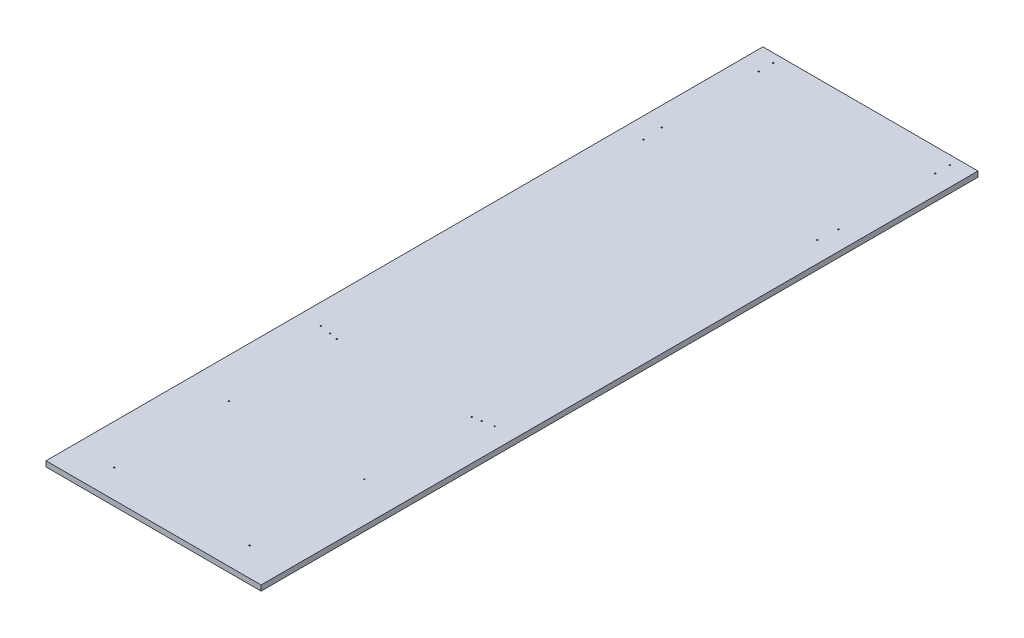
ISO-10303-21;
HEADER;
FILE_DESCRIPTION(('STEP AP214'),'2;1');
FILE_NAME('part.step','',(''),(''),'','','');
FILE_SCHEMA(('AUTOMOTIVE_DESIGN { 1 0 10303 214 1 1 1 1 }'));
ENDSEC;
DATA;
#1=APPLICATION_CONTEXT('core data for automotive mechanical design processes');
#2=APPLICATION_PROTOCOL_DEFINITION('international standard','automotive_design',2000,#1);
#3=PRODUCT_CONTEXT('',#1,'mechanical');
#4=PRODUCT('Part','Part','',(#3));
#5=PRODUCT_RELATED_PRODUCT_CATEGORY('part','',(#4));
#6=PRODUCT_DEFINITION_FORMATION('','',#4);
#7=PRODUCT_DEFINITION_CONTEXT('part definition',#1,'design');
#8=PRODUCT_DEFINITION('design','',#6,#7);
#9=PRODUCT_DEFINITION_SHAPE('','',#8);
#10=(LENGTH_UNIT() NAMED_UNIT(*) SI_UNIT(.MILLI.,.METRE.));
#11=(NAMED_UNIT(*) PLANE_ANGLE_UNIT() SI_UNIT($,.RADIAN.));
#12=(NAMED_UNIT(*) SI_UNIT($,.STERADIAN.) SOLID_ANGLE_UNIT());
#13=UNCERTAINTY_MEASURE_WITH_UNIT(LENGTH_MEASURE(1.E-05),#10,'distance_accuracy_value','');
#14=(GEOMETRIC_REPRESENTATION_CONTEXT(3) GLOBAL_UNCERTAINTY_ASSIGNED_CONTEXT((#13)) GLOBAL_UNIT_ASSIGNED_CONTEXT((#10,
#11,#12)) REPRESENTATION_CONTEXT('',''));
#15=CARTESIAN_POINT('',(0.,0.,0.));
#16=DIRECTION('',(0.,0.,1.));
#17=DIRECTION('',(1.,0.,0.));
#18=AXIS2_PLACEMENT_3D('',#15,#16,#17);
#19=CARTESIAN_POINT('',(0.,15.,0.));
#20=DIRECTION('',(0.,1.,0.));
#21=DIRECTION('',(0.,0.,1.));
#22=AXIS2_PLACEMENT_3D('',#19,#20,#21);
#23=PLANE('',#22);
#24=CARTESIAN_POINT('',(246.5,15.,-934.289321881345));
#25=DIRECTION('',(0.,1.,0.));
#26=DIRECTION('',(0.,0.,1.));
#27=AXIS2_PLACEMENT_3D('',#24,#25,#26);
#28=CIRCLE('',#27,1.74999999999999);
#29=CARTESIAN_POINT('',(246.5,15.,-932.539321881345));
#30=VERTEX_POINT('',#29);
#31=EDGE_CURVE('E205',#30,#30,#28,.T.);
#32=ORIENTED_EDGE('',*,*,#31,.F.);
#33=EDGE_LOOP('',(#32));
#34=FACE_BOUND('',#33,.T.);
#35=CARTESIAN_POINT('',(-246.5,15.,-934.289321881345));
#36=DIRECTION('',(0.,1.,0.));
#37=DIRECTION('',(0.,0.,1.));
#38=AXIS2_PLACEMENT_3D('',#35,#36,#37);
#39=CIRCLE('',#38,1.74999999999999);
#40=CARTESIAN_POINT('',(-246.5,15.,-932.539321881345));
#41=VERTEX_POINT('',#40);
#42=EDGE_CURVE('E193',#41,#41,#39,.T.);
#43=ORIENTED_EDGE('',*,*,#42,.F.);
#44=EDGE_LOOP('',(#43));
#45=FACE_BOUND('',#44,.T.);
#46=CARTESIAN_POINT('',(246.5,15.,-664.289321881345));
#47=DIRECTION('',(0.,1.,0.));
#48=DIRECTION('',(0.,0.,1.));
#49=AXIS2_PLACEMENT_3D('',#46,#47,#48);
#50=CIRCLE('',#49,1.74999999999997);
#51=CARTESIAN_POINT('',(246.5,15.,-662.539321881345));
#52=VERTEX_POINT('',#51);
#53=EDGE_CURVE('E181',#52,#52,#50,.T.);
#54=ORIENTED_EDGE('',*,*,#53,.F.);
#55=EDGE_LOOP('',(#54));
#56=FACE_BOUND('',#55,.T.);
#57=CARTESIAN_POINT('',(242.5,15.,290.710678118655));
#58=DIRECTION('',(0.,1.,0.));
#59=DIRECTION('',(0.,0.,1.));
#60=AXIS2_PLACEMENT_3D('',#57,#58,#59);
#61=CIRCLE('',#60,1.74999999999998);
#62=CARTESIAN_POINT('',(242.5,15.,292.460678118655));
#63=VERTEX_POINT('',#62);
#64=EDGE_CURVE('E169',#63,#63,#61,.T.);
#65=ORIENTED_EDGE('',*,*,#64,.F.);
#66=EDGE_LOOP('',(#65));
#67=FACE_BOUND('',#66,.T.);
#68=CARTESIAN_POINT('',(-242.5,15.,290.710678118655));
#69=DIRECTION('',(0.,1.,0.));
#70=DIRECTION('',(0.,0.,1.));
#71=AXIS2_PLACEMENT_3D('',#68,#69,#70);
#72=CIRCLE('',#71,1.75000000000001);
#73=CARTESIAN_POINT('',(-242.5,15.,292.460678118655));
#74=VERTEX_POINT('',#73);
#75=EDGE_CURVE('E157',#74,#74,#72,.T.);
#76=ORIENTED_EDGE('',*,*,#75,.F.);
#77=EDGE_LOOP('',(#76));
#78=FACE_BOUND('',#77,.T.);
#79=CARTESIAN_POINT('',(-211.5,15.,295.710678118655));
#80=DIRECTION('',(0.,1.,0.));
#81=DIRECTION('',(0.,0.,1.));
#82=AXIS2_PLACEMENT_3D('',#79,#80,#81);
#83=CIRCLE('',#82,1.75000000000001);
#84=CARTESIAN_POINT('',(-211.5,15.,297.460678118655));
#85=VERTEX_POINT('',#84);
#86=EDGE_CURVE('E145',#85,#85,#83,.T.);
#87=ORIENTED_EDGE('',*,*,#86,.F.);
#88=EDGE_LOOP('',(#87));
#89=FACE_BOUND('',#88,.T.);
#90=CARTESIAN_POINT('',(-188.5,15.,600.710678118655));
#91=DIRECTION('',(0.,1.,0.));
#92=DIRECTION('',(0.,0.,1.));
#93=AXIS2_PLACEMENT_3D('',#90,#91,#92);
#94=CIRCLE('',#93,1.74999999999999);
#95=CARTESIAN_POINT('',(-188.5,15.,602.460678118655));
#96=VERTEX_POINT('',#95);
#97=EDGE_CURVE('E133',#96,#96,#94,.T.);
#98=ORIENTED_EDGE('',*,*,#97,.F.);
#99=EDGE_LOOP('',(#98));
#100=FACE_BOUND('',#99,.T.);
#101=CARTESIAN_POINT('',(188.5,15.,600.710678118655));
#102=DIRECTION('',(0.,1.,0.));
#103=DIRECTION('',(0.,0.,1.));
#104=AXIS2_PLACEMENT_3D('',#101,#102,#103);
#105=CIRCLE('',#104,1.74999999999999);
#106=CARTESIAN_POINT('',(188.5,15.,602.460678118655));
#107=VERTEX_POINT('',#106);
#108=EDGE_CURVE('E121',#107,#107,#105,.T.);
#109=ORIENTED_EDGE('',*,*,#108,.F.);
#110=EDGE_LOOP('',(#109));
#111=FACE_BOUND('',#110,.T.);
#112=CARTESIAN_POINT('',(-188.5,15.,920.710678118655));
#113=DIRECTION('',(0.,1.,0.));
#114=DIRECTION('',(0.,0.,1.));
#115=AXIS2_PLACEMENT_3D('',#112,#113,#114);
#116=CIRCLE('',#115,1.74999999999999);
#117=CARTESIAN_POINT('',(-188.5,15.,922.460678118655));
#118=VERTEX_POINT('',#117);
#119=EDGE_CURVE('E100',#118,#118,#116,.T.);
#120=ORIENTED_EDGE('',*,*,#119,.F.);
#121=EDGE_LOOP('',(#120));
#122=FACE_BOUND('',#121,.T.);
#123=DIRECTION('',(0.,0.,-1.));
#124=VECTOR('',#123,1.);
#125=CARTESIAN_POINT('',(300.,15.,-1000.));
#126=LINE('',#125,#124);
#127=CARTESIAN_POINT('',(300.,15.,1000.));
#128=VERTEX_POINT('',#127);
#129=CARTESIAN_POINT('',(300.,15.,-1000.));
#130=VERTEX_POINT('',#129);
#131=EDGE_CURVE('E85',#128,#130,#126,.T.);
#132=ORIENTED_EDGE('',*,*,#131,.T.);
#133=DIRECTION('',(-1.,0.,0.));
#134=VECTOR('',#133,1.);
#135=CARTESIAN_POINT('',(-300.,15.,-1000.));
#136=LINE('',#135,#134);
#137=CARTESIAN_POINT('',(-300.,15.,-1000.));
#138=VERTEX_POINT('',#137);
#139=EDGE_CURVE('E80',#130,#138,#136,.T.);
#140=ORIENTED_EDGE('',*,*,#139,.T.);
#141=DIRECTION('',(0.,0.,1.));
#142=VECTOR('',#141,1.);
#143=CARTESIAN_POINT('',(-300.,15.,-1000.));
#144=LINE('',#143,#142);
#145=CARTESIAN_POINT('',(-300.,15.,1000.));
#146=VERTEX_POINT('',#145);
#147=EDGE_CURVE('E83',#138,#146,#144,.T.);
#148=ORIENTED_EDGE('',*,*,#147,.T.);
#149=DIRECTION('',(1.,0.,0.));
#150=VECTOR('',#149,1.);
#151=CARTESIAN_POINT('',(-300.,15.,1000.));
#152=LINE('',#151,#150);
#153=EDGE_CURVE('E50',#146,#128,#152,.T.);
#154=ORIENTED_EDGE('',*,*,#153,.T.);
#155=EDGE_LOOP('',(#132,#140,#148,#154));
#156=FACE_BOUND('',#155,.T.);
#157=CARTESIAN_POINT('',(188.5,15.,920.710678118655));
#158=DIRECTION('',(0.,1.,0.));
#159=DIRECTION('',(0.,0.,1.));
#160=AXIS2_PLACEMENT_3D('',#157,#158,#159);
#161=CIRCLE('',#160,1.74999999999999);
#162=CARTESIAN_POINT('',(188.5,15.,922.460678118655));
#163=VERTEX_POINT('',#162);
#164=EDGE_CURVE('E115',#163,#163,#161,.T.);
#165=ORIENTED_EDGE('',*,*,#164,.F.);
#166=EDGE_LOOP('',(#165));
#167=FACE_BOUND('',#166,.T.);
#168=CARTESIAN_POINT('',(-188.5,15.,300.710678118655));
#169=DIRECTION('',(0.,1.,0.));
#170=DIRECTION('',(0.,0.,1.));
#171=AXIS2_PLACEMENT_3D('',#168,#169,#170);
#172=CIRCLE('',#171,1.75000000000001);
#173=CARTESIAN_POINT('',(-188.5,15.,302.460678118655));
#174=VERTEX_POINT('',#173);
#175=EDGE_CURVE('E127',#174,#174,#172,.T.);
#176=ORIENTED_EDGE('',*,*,#175,.F.);
#177=EDGE_LOOP('',(#176));
#178=FACE_BOUND('',#177,.T.);
#179=CARTESIAN_POINT('',(188.5,15.,300.710678118655));
#180=DIRECTION('',(0.,1.,0.));
#181=DIRECTION('',(0.,0.,1.));
#182=AXIS2_PLACEMENT_3D('',#179,#180,#181);
#183=CIRCLE('',#182,1.75000000000001);
#184=CARTESIAN_POINT('',(188.5,15.,302.460678118655));
#185=VERTEX_POINT('',#184);
#186=EDGE_CURVE('E139',#185,#185,#183,.T.);
#187=ORIENTED_EDGE('',*,*,#186,.F.);
#188=EDGE_LOOP('',(#187));
#189=FACE_BOUND('',#188,.T.);
#190=CARTESIAN_POINT('',(211.5,15.,295.710678118655));
#191=DIRECTION('',(0.,1.,0.));
#192=DIRECTION('',(0.,0.,1.));
#193=AXIS2_PLACEMENT_3D('',#190,#191,#192);
#194=CIRCLE('',#193,1.75000000000001);
#195=CARTESIAN_POINT('',(211.5,15.,297.460678118655));
#196=VERTEX_POINT('',#195);
#197=EDGE_CURVE('E151',#196,#196,#194,.T.);
#198=ORIENTED_EDGE('',*,*,#197,.F.);
#199=EDGE_LOOP('',(#198));
#200=FACE_BOUND('',#199,.T.);
#201=CARTESIAN_POINT('',(-242.5,15.,-609.289321881345));
#202=DIRECTION('',(0.,1.,0.));
#203=DIRECTION('',(0.,0.,1.));
#204=AXIS2_PLACEMENT_3D('',#201,#202,#203);
#205=CIRCLE('',#204,1.75000000000013);
#206=CARTESIAN_POINT('',(-242.5,15.,-607.539321881345));
#207=VERTEX_POINT('',#206);
#208=EDGE_CURVE('E163',#207,#207,#205,.T.);
#209=ORIENTED_EDGE('',*,*,#208,.F.);
#210=EDGE_LOOP('',(#209));
#211=FACE_BOUND('',#210,.T.);
#212=CARTESIAN_POINT('',(242.5,15.,-609.289321881345));
#213=DIRECTION('',(0.,1.,0.));
#214=DIRECTION('',(0.,0.,1.));
#215=AXIS2_PLACEMENT_3D('',#212,#213,#214);
#216=CIRCLE('',#215,1.74999999999997);
#217=CARTESIAN_POINT('',(242.5,15.,-607.539321881345));
#218=VERTEX_POINT('',#217);
#219=EDGE_CURVE('E175',#218,#218,#216,.T.);
#220=ORIENTED_EDGE('',*,*,#219,.F.);
#221=EDGE_LOOP('',(#220));
#222=FACE_BOUND('',#221,.T.);
#223=CARTESIAN_POINT('',(-246.5,15.,-664.289321881345));
#224=DIRECTION('',(0.,1.,0.));
#225=DIRECTION('',(0.,0.,1.));
#226=AXIS2_PLACEMENT_3D('',#223,#224,#225);
#227=CIRCLE('',#226,1.75000000000013);
#228=CARTESIAN_POINT('',(-246.5,15.,-662.539321881345));
#229=VERTEX_POINT('',#228);
#230=EDGE_CURVE('E187',#229,#229,#227,.T.);
#231=ORIENTED_EDGE('',*,*,#230,.F.);
#232=EDGE_LOOP('',(#231));
#233=FACE_BOUND('',#232,.T.);
#234=CARTESIAN_POINT('',(-246.5,15.,-975.));
#235=DIRECTION('',(0.,1.,0.));
#236=DIRECTION('',(0.,0.,1.));
#237=AXIS2_PLACEMENT_3D('',#234,#235,#236);
#238=CIRCLE('',#237,1.74999999999999);
#239=CARTESIAN_POINT('',(-246.5,15.,-973.25));
#240=VERTEX_POINT('',#239);
#241=EDGE_CURVE('E199',#240,#240,#238,.T.);
#242=ORIENTED_EDGE('',*,*,#241,.F.);
#243=EDGE_LOOP('',(#242));
#244=FACE_BOUND('',#243,.T.);
#245=CARTESIAN_POINT('',(246.5,15.,-975.));
#246=DIRECTION('',(0.,1.,0.));
#247=DIRECTION('',(0.,0.,1.));
#248=AXIS2_PLACEMENT_3D('',#245,#246,#247);
#249=CIRCLE('',#248,1.74999999999999);
#250=CARTESIAN_POINT('',(246.5,15.,-973.25));
#251=VERTEX_POINT('',#250);
#252=EDGE_CURVE('E211',#251,#251,#249,.T.);
#253=ORIENTED_EDGE('',*,*,#252,.F.);
#254=EDGE_LOOP('',(#253));
#255=FACE_BOUND('',#254,.T.);
#256=ADVANCED_FACE('F33',(#34,#45,#56,#67,#78,#89,#100,#111,#122,#156,#167,#178,#189,#200,#211,
#222,#233,#244,#255),#23,.T.);
#257=CARTESIAN_POINT('',(0.,0.,0.));
#258=DIRECTION('',(0.,1.,0.));
#259=DIRECTION('',(0.,0.,1.));
#260=AXIS2_PLACEMENT_3D('',#257,#258,#259);
#261=PLANE('',#260);
#262=DIRECTION('',(0.,0.,-1.));
#263=VECTOR('',#262,1.);
#264=CARTESIAN_POINT('',(300.,0.,-1000.));
#265=LINE('',#264,#263);
#266=CARTESIAN_POINT('',(300.,0.,1000.));
#267=VERTEX_POINT('',#266);
#268=CARTESIAN_POINT('',(300.,0.,-1000.));
#269=VERTEX_POINT('',#268);
#270=EDGE_CURVE('E97',#267,#269,#265,.T.);
#271=ORIENTED_EDGE('',*,*,#270,.F.);
#272=DIRECTION('',(1.,0.,0.));
#273=VECTOR('',#272,1.);
#274=CARTESIAN_POINT('',(-300.,0.,1000.));
#275=LINE('',#274,#273);
#276=CARTESIAN_POINT('',(-300.,0.,1000.));
#277=VERTEX_POINT('',#276);
#278=EDGE_CURVE('E73',#277,#267,#275,.T.);
#279=ORIENTED_EDGE('',*,*,#278,.F.);
#280=DIRECTION('',(0.,0.,1.));
#281=VECTOR('',#280,1.);
#282=CARTESIAN_POINT('',(-300.,0.,-1000.));
#283=LINE('',#282,#281);
#284=CARTESIAN_POINT('',(-300.,0.,-1000.));
#285=VERTEX_POINT('',#284);
#286=EDGE_CURVE('E67',#285,#277,#283,.T.);
#287=ORIENTED_EDGE('',*,*,#286,.F.);
#288=DIRECTION('',(-1.,0.,0.));
#289=VECTOR('',#288,1.);
#290=CARTESIAN_POINT('',(-300.,0.,-1000.));
#291=LINE('',#290,#289);
#292=EDGE_CURVE('E89',#269,#285,#291,.T.);
#293=ORIENTED_EDGE('',*,*,#292,.F.);
#294=EDGE_LOOP('',(#271,#279,#287,#293));
#295=FACE_BOUND('',#294,.T.);
#296=CARTESIAN_POINT('',(-188.5,0.,920.710678118655));
#297=DIRECTION('',(0.,1.,0.));
#298=DIRECTION('',(0.,0.,1.));
#299=AXIS2_PLACEMENT_3D('',#296,#297,#298);
#300=CIRCLE('',#299,1.74999999999999);
#301=CARTESIAN_POINT('',(-188.5,0.,922.460678118655));
#302=VERTEX_POINT('',#301);
#303=EDGE_CURVE('E112',#302,#302,#300,.T.);
#304=ORIENTED_EDGE('',*,*,#303,.T.);
#305=EDGE_LOOP('',(#304));
#306=FACE_BOUND('',#305,.T.);
#307=CARTESIAN_POINT('',(188.5,0.,920.710678118655));
#308=DIRECTION('',(0.,1.,0.));
#309=DIRECTION('',(0.,0.,1.));
#310=AXIS2_PLACEMENT_3D('',#307,#308,#309);
#311=CIRCLE('',#310,1.74999999999999);
#312=CARTESIAN_POINT('',(188.5,0.,922.460678118655));
#313=VERTEX_POINT('',#312);
#314=EDGE_CURVE('E118',#313,#313,#311,.T.);
#315=ORIENTED_EDGE('',*,*,#314,.T.);
#316=EDGE_LOOP('',(#315));
#317=FACE_BOUND('',#316,.T.);
#318=CARTESIAN_POINT('',(188.5,0.,600.710678118655));
#319=DIRECTION('',(0.,1.,0.));
#320=DIRECTION('',(0.,0.,1.));
#321=AXIS2_PLACEMENT_3D('',#318,#319,#320);
#322=CIRCLE('',#321,1.74999999999999);
#323=CARTESIAN_POINT('',(188.5,0.,602.460678118655));
#324=VERTEX_POINT('',#323);
#325=EDGE_CURVE('E124',#324,#324,#322,.T.);
#326=ORIENTED_EDGE('',*,*,#325,.T.);
#327=EDGE_LOOP('',(#326));
#328=FACE_BOUND('',#327,.T.);
#329=CARTESIAN_POINT('',(-188.5,0.,300.710678118655));
#330=DIRECTION('',(0.,1.,0.));
#331=DIRECTION('',(0.,0.,1.));
#332=AXIS2_PLACEMENT_3D('',#329,#330,#331);
#333=CIRCLE('',#332,1.75000000000001);
#334=CARTESIAN_POINT('',(-188.5,0.,302.460678118655));
#335=VERTEX_POINT('',#334);
#336=EDGE_CURVE('E130',#335,#335,#333,.T.);
#337=ORIENTED_EDGE('',*,*,#336,.T.);
#338=EDGE_LOOP('',(#337));
#339=FACE_BOUND('',#338,.T.);
#340=CARTESIAN_POINT('',(-188.5,0.,600.710678118655));
#341=DIRECTION('',(0.,1.,0.));
#342=DIRECTION('',(0.,0.,1.));
#343=AXIS2_PLACEMENT_3D('',#340,#341,#342);
#344=CIRCLE('',#343,1.74999999999999);
#345=CARTESIAN_POINT('',(-188.5,0.,602.460678118655));
#346=VERTEX_POINT('',#345);
#347=EDGE_CURVE('E136',#346,#346,#344,.T.);
#348=ORIENTED_EDGE('',*,*,#347,.T.);
#349=EDGE_LOOP('',(#348));
#350=FACE_BOUND('',#349,.T.);
#351=CARTESIAN_POINT('',(188.5,0.,300.710678118655));
#352=DIRECTION('',(0.,1.,0.));
#353=DIRECTION('',(0.,0.,1.));
#354=AXIS2_PLACEMENT_3D('',#351,#352,#353);
#355=CIRCLE('',#354,1.75000000000001);
#356=CARTESIAN_POINT('',(188.5,0.,302.460678118655));
#357=VERTEX_POINT('',#356);
#358=EDGE_CURVE('E142',#357,#357,#355,.T.);
#359=ORIENTED_EDGE('',*,*,#358,.T.);
#360=EDGE_LOOP('',(#359));
#361=FACE_BOUND('',#360,.T.);
#362=CARTESIAN_POINT('',(-211.5,0.,295.710678118655));
#363=DIRECTION('',(0.,1.,0.));
#364=DIRECTION('',(0.,0.,1.));
#365=AXIS2_PLACEMENT_3D('',#362,#363,#364);
#366=CIRCLE('',#365,1.75000000000001);
#367=CARTESIAN_POINT('',(-211.5,0.,297.460678118655));
#368=VERTEX_POINT('',#367);
#369=EDGE_CURVE('E148',#368,#368,#366,.T.);
#370=ORIENTED_EDGE('',*,*,#369,.T.);
#371=EDGE_LOOP('',(#370));
#372=FACE_BOUND('',#371,.T.);
#373=CARTESIAN_POINT('',(211.5,0.,295.710678118655));
#374=DIRECTION('',(0.,1.,0.));
#375=DIRECTION('',(0.,0.,1.));
#376=AXIS2_PLACEMENT_3D('',#373,#374,#375);
#377=CIRCLE('',#376,1.75000000000001);
#378=CARTESIAN_POINT('',(211.5,0.,297.460678118655));
#379=VERTEX_POINT('',#378);
#380=EDGE_CURVE('E154',#379,#379,#377,.T.);
#381=ORIENTED_EDGE('',*,*,#380,.T.);
#382=EDGE_LOOP('',(#381));
#383=FACE_BOUND('',#382,.T.);
#384=CARTESIAN_POINT('',(-242.5,0.,290.710678118655));
#385=DIRECTION('',(0.,1.,0.));
#386=DIRECTION('',(0.,0.,1.));
#387=AXIS2_PLACEMENT_3D('',#384,#385,#386);
#388=CIRCLE('',#387,1.75000000000001);
#389=CARTESIAN_POINT('',(-242.5,0.,292.460678118655));
#390=VERTEX_POINT('',#389);
#391=EDGE_CURVE('E160',#390,#390,#388,.T.);
#392=ORIENTED_EDGE('',*,*,#391,.T.);
#393=EDGE_LOOP('',(#392));
#394=FACE_BOUND('',#393,.T.);
#395=CARTESIAN_POINT('',(-242.5,0.,-609.289321881345));
#396=DIRECTION('',(0.,1.,0.));
#397=DIRECTION('',(0.,0.,1.));
#398=AXIS2_PLACEMENT_3D('',#395,#396,#397);
#399=CIRCLE('',#398,1.75000000000013);
#400=CARTESIAN_POINT('',(-242.5,0.,-607.539321881345));
#401=VERTEX_POINT('',#400);
#402=EDGE_CURVE('E166',#401,#401,#399,.T.);
#403=ORIENTED_EDGE('',*,*,#402,.T.);
#404=EDGE_LOOP('',(#403));
#405=FACE_BOUND('',#404,.T.);
#406=CARTESIAN_POINT('',(242.5,0.,290.710678118655));
#407=DIRECTION('',(0.,1.,0.));
#408=DIRECTION('',(0.,0.,1.));
#409=AXIS2_PLACEMENT_3D('',#406,#407,#408);
#410=CIRCLE('',#409,1.74999999999998);
#411=CARTESIAN_POINT('',(242.5,0.,292.460678118655));
#412=VERTEX_POINT('',#411);
#413=EDGE_CURVE('E172',#412,#412,#410,.T.);
#414=ORIENTED_EDGE('',*,*,#413,.T.);
#415=EDGE_LOOP('',(#414));
#416=FACE_BOUND('',#415,.T.);
#417=CARTESIAN_POINT('',(242.5,0.,-609.289321881345));
#418=DIRECTION('',(0.,1.,0.));
#419=DIRECTION('',(0.,0.,1.));
#420=AXIS2_PLACEMENT_3D('',#417,#418,#419);
#421=CIRCLE('',#420,1.74999999999997);
#422=CARTESIAN_POINT('',(242.5,0.,-607.539321881345));
#423=VERTEX_POINT('',#422);
#424=EDGE_CURVE('E178',#423,#423,#421,.T.);
#425=ORIENTED_EDGE('',*,*,#424,.T.);
#426=EDGE_LOOP('',(#425));
#427=FACE_BOUND('',#426,.T.);
#428=CARTESIAN_POINT('',(246.5,0.,-664.289321881345));
#429=DIRECTION('',(0.,1.,0.));
#430=DIRECTION('',(0.,0.,1.));
#431=AXIS2_PLACEMENT_3D('',#428,#429,#430);
#432=CIRCLE('',#431,1.74999999999997);
#433=CARTESIAN_POINT('',(246.5,0.,-662.539321881345));
#434=VERTEX_POINT('',#433);
#435=EDGE_CURVE('E184',#434,#434,#432,.T.);
#436=ORIENTED_EDGE('',*,*,#435,.T.);
#437=EDGE_LOOP('',(#436));
#438=FACE_BOUND('',#437,.T.);
#439=CARTESIAN_POINT('',(-246.5,0.,-664.289321881345));
#440=DIRECTION('',(0.,1.,0.));
#441=DIRECTION('',(0.,0.,1.));
#442=AXIS2_PLACEMENT_3D('',#439,#440,#441);
#443=CIRCLE('',#442,1.75000000000013);
#444=CARTESIAN_POINT('',(-246.5,0.,-662.539321881345));
#445=VERTEX_POINT('',#444);
#446=EDGE_CURVE('E190',#445,#445,#443,.T.);
#447=ORIENTED_EDGE('',*,*,#446,.T.);
#448=EDGE_LOOP('',(#447));
#449=FACE_BOUND('',#448,.T.);
#450=CARTESIAN_POINT('',(-246.5,0.,-934.289321881345));
#451=DIRECTION('',(0.,1.,0.));
#452=DIRECTION('',(0.,0.,1.));
#453=AXIS2_PLACEMENT_3D('',#450,#451,#452);
#454=CIRCLE('',#453,1.74999999999999);
#455=CARTESIAN_POINT('',(-246.5,0.,-932.539321881345));
#456=VERTEX_POINT('',#455);
#457=EDGE_CURVE('E196',#456,#456,#454,.T.);
#458=ORIENTED_EDGE('',*,*,#457,.T.);
#459=EDGE_LOOP('',(#458));
#460=FACE_BOUND('',#459,.T.);
#461=CARTESIAN_POINT('',(-246.5,0.,-975.));
#462=DIRECTION('',(0.,1.,0.));
#463=DIRECTION('',(0.,0.,1.));
#464=AXIS2_PLACEMENT_3D('',#461,#462,#463);
#465=CIRCLE('',#464,1.74999999999999);
#466=CARTESIAN_POINT('',(-246.5,0.,-973.25));
#467=VERTEX_POINT('',#466);
#468=EDGE_CURVE('E202',#467,#467,#465,.T.);
#469=ORIENTED_EDGE('',*,*,#468,.T.);
#470=EDGE_LOOP('',(#469));
#471=FACE_BOUND('',#470,.T.);
#472=CARTESIAN_POINT('',(246.5,0.,-934.289321881345));
#473=DIRECTION('',(0.,1.,0.));
#474=DIRECTION('',(0.,0.,1.));
#475=AXIS2_PLACEMENT_3D('',#472,#473,#474);
#476=CIRCLE('',#475,1.74999999999999);
#477=CARTESIAN_POINT('',(246.5,0.,-932.539321881345));
#478=VERTEX_POINT('',#477);
#479=EDGE_CURVE('E208',#478,#478,#476,.T.);
#480=ORIENTED_EDGE('',*,*,#479,.T.);
#481=EDGE_LOOP('',(#480));
#482=FACE_BOUND('',#481,.T.);
#483=CARTESIAN_POINT('',(246.5,0.,-975.));
#484=DIRECTION('',(0.,1.,0.));
#485=DIRECTION('',(0.,0.,1.));
#486=AXIS2_PLACEMENT_3D('',#483,#484,#485);
#487=CIRCLE('',#486,1.74999999999999);
#488=CARTESIAN_POINT('',(246.5,0.,-973.25));
#489=VERTEX_POINT('',#488);
#490=EDGE_CURVE('E214',#489,#489,#487,.T.);
#491=ORIENTED_EDGE('',*,*,#490,.T.);
#492=EDGE_LOOP('',(#491));
#493=FACE_BOUND('',#492,.T.);
#494=ADVANCED_FACE('F108',(#295,#306,#317,#328,#339,#350,#361,#372,#383,#394,#405,#416,#427,
#438,#449,#460,#471,#482,#493),#261,.F.);
#495=CARTESIAN_POINT('',(300.,15.,-1000.));
#496=DIRECTION('',(-1.,0.,0.));
#497=DIRECTION('',(0.,0.,1.));
#498=AXIS2_PLACEMENT_3D('',#495,#496,#497);
#499=PLANE('',#498);
#500=ORIENTED_EDGE('',*,*,#270,.T.);
#501=DIRECTION('',(0.,-1.,0.));
#502=VECTOR('',#501,1.);
#503=CARTESIAN_POINT('',(300.,15.,-1000.));
#504=LINE('',#503,#502);
#505=EDGE_CURVE('E11',#130,#269,#504,.T.);
#506=ORIENTED_EDGE('',*,*,#505,.F.);
#507=ORIENTED_EDGE('',*,*,#131,.F.);
#508=DIRECTION('',(0.,-1.,0.));
#509=VECTOR('',#508,1.);
#510=CARTESIAN_POINT('',(300.,15.,1000.));
#511=LINE('',#510,#509);
#512=EDGE_CURVE('E93',#128,#267,#511,.T.);
#513=ORIENTED_EDGE('',*,*,#512,.T.);
#514=EDGE_LOOP('',(#500,#506,#507,#513));
#515=FACE_BOUND('',#514,.T.);
#516=ADVANCED_FACE('F35',(#515),#499,.F.);
#517=CARTESIAN_POINT('',(-300.,15.,-1000.));
#518=DIRECTION('',(0.,0.,1.));
#519=DIRECTION('',(1.,0.,0.));
#520=AXIS2_PLACEMENT_3D('',#517,#518,#519);
#521=PLANE('',#520);
#522=ORIENTED_EDGE('',*,*,#292,.T.);
#523=DIRECTION('',(0.,-1.,0.));
#524=VECTOR('',#523,1.);
#525=CARTESIAN_POINT('',(-300.,15.,-1000.));
#526=LINE('',#525,#524);
#527=EDGE_CURVE('E42',#138,#285,#526,.T.);
#528=ORIENTED_EDGE('',*,*,#527,.F.);
#529=ORIENTED_EDGE('',*,*,#139,.F.);
#530=ORIENTED_EDGE('',*,*,#505,.T.);
#531=EDGE_LOOP('',(#522,#528,#529,#530));
#532=FACE_BOUND('',#531,.T.);
#533=ADVANCED_FACE('F88',(#532),#521,.F.);
#534=CARTESIAN_POINT('',(-300.,15.,-1000.));
#535=DIRECTION('',(1.,0.,0.));
#536=DIRECTION('',(0.,0.,-1.));
#537=AXIS2_PLACEMENT_3D('',#534,#535,#536);
#538=PLANE('',#537);
#539=ORIENTED_EDGE('',*,*,#286,.T.);
#540=DIRECTION('',(0.,-1.,0.));
#541=VECTOR('',#540,1.);
#542=CARTESIAN_POINT('',(-300.,15.,1000.));
#543=LINE('',#542,#541);
#544=EDGE_CURVE('E90',#146,#277,#543,.T.);
#545=ORIENTED_EDGE('',*,*,#544,.F.);
#546=ORIENTED_EDGE('',*,*,#147,.F.);
#547=ORIENTED_EDGE('',*,*,#527,.T.);
#548=EDGE_LOOP('',(#539,#545,#546,#547));
#549=FACE_BOUND('',#548,.T.);
#550=ADVANCED_FACE('F91',(#549),#538,.F.);
#551=CARTESIAN_POINT('',(-300.,15.,1000.));
#552=DIRECTION('',(0.,0.,-1.));
#553=DIRECTION('',(-1.,0.,0.));
#554=AXIS2_PLACEMENT_3D('',#551,#552,#553);
#555=PLANE('',#554);
#556=ORIENTED_EDGE('',*,*,#278,.T.);
#557=ORIENTED_EDGE('',*,*,#512,.F.);
#558=ORIENTED_EDGE('',*,*,#153,.F.);
#559=ORIENTED_EDGE('',*,*,#544,.T.);
#560=EDGE_LOOP('',(#556,#557,#558,#559));
#561=FACE_BOUND('',#560,.T.);
#562=ADVANCED_FACE('F105',(#561),#555,.F.);
#563=CARTESIAN_POINT('',(-188.5,15.,920.710678118655));
#564=DIRECTION('',(0.,-1.,0.));
#565=DIRECTION('',(0.,0.,-1.));
#566=AXIS2_PLACEMENT_3D('',#563,#564,#565);
#567=CYLINDRICAL_SURFACE('',#566,1.74999999999999);
#568=ORIENTED_EDGE('',*,*,#119,.T.);
#569=EDGE_LOOP('',(#568));
#570=FACE_BOUND('',#569,.T.);
#571=ORIENTED_EDGE('',*,*,#303,.F.);
#572=EDGE_LOOP('',(#571));
#573=FACE_BOUND('',#572,.T.);
#574=ADVANCED_FACE('F233',(#570,#573),#567,.F.);
#575=CARTESIAN_POINT('',(188.5,15.,920.710678118655));
#576=DIRECTION('',(0.,-1.,0.));
#577=DIRECTION('',(0.,0.,-1.));
#578=AXIS2_PLACEMENT_3D('',#575,#576,#577);
#579=CYLINDRICAL_SURFACE('',#578,1.74999999999999);
#580=ORIENTED_EDGE('',*,*,#164,.T.);
#581=EDGE_LOOP('',(#580));
#582=FACE_BOUND('',#581,.T.);
#583=ORIENTED_EDGE('',*,*,#314,.F.);
#584=EDGE_LOOP('',(#583));
#585=FACE_BOUND('',#584,.T.);
#586=ADVANCED_FACE('F279',(#582,#585),#579,.F.);
#587=CARTESIAN_POINT('',(188.5,15.,600.710678118655));
#588=DIRECTION('',(0.,-1.,0.));
#589=DIRECTION('',(0.,0.,-1.));
#590=AXIS2_PLACEMENT_3D('',#587,#588,#589);
#591=CYLINDRICAL_SURFACE('',#590,1.74999999999999);
#592=ORIENTED_EDGE('',*,*,#108,.T.);
#593=EDGE_LOOP('',(#592));
#594=FACE_BOUND('',#593,.T.);
#595=ORIENTED_EDGE('',*,*,#325,.F.);
#596=EDGE_LOOP('',(#595));
#597=FACE_BOUND('',#596,.T.);
#598=ADVANCED_FACE('F287',(#594,#597),#591,.F.);
#599=CARTESIAN_POINT('',(-188.5,15.,300.710678118655));
#600=DIRECTION('',(0.,-1.,0.));
#601=DIRECTION('',(0.,0.,-1.));
#602=AXIS2_PLACEMENT_3D('',#599,#600,#601);
#603=CYLINDRICAL_SURFACE('',#602,1.75000000000001);
#604=ORIENTED_EDGE('',*,*,#175,.T.);
#605=EDGE_LOOP('',(#604));
#606=FACE_BOUND('',#605,.T.);
#607=ORIENTED_EDGE('',*,*,#336,.F.);
#608=EDGE_LOOP('',(#607));
#609=FACE_BOUND('',#608,.T.);
#610=ADVANCED_FACE('F295',(#606,#609),#603,.F.);
#611=CARTESIAN_POINT('',(-188.5,15.,600.710678118655));
#612=DIRECTION('',(0.,-1.,0.));
#613=DIRECTION('',(0.,0.,-1.));
#614=AXIS2_PLACEMENT_3D('',#611,#612,#613);
#615=CYLINDRICAL_SURFACE('',#614,1.74999999999999);
#616=ORIENTED_EDGE('',*,*,#97,.T.);
#617=EDGE_LOOP('',(#616));
#618=FACE_BOUND('',#617,.T.);
#619=ORIENTED_EDGE('',*,*,#347,.F.);
#620=EDGE_LOOP('',(#619));
#621=FACE_BOUND('',#620,.T.);
#622=ADVANCED_FACE('F304',(#618,#621),#615,.F.);
#623=CARTESIAN_POINT('',(188.5,15.,300.710678118655));
#624=DIRECTION('',(0.,-1.,0.));
#625=DIRECTION('',(0.,0.,-1.));
#626=AXIS2_PLACEMENT_3D('',#623,#624,#625);
#627=CYLINDRICAL_SURFACE('',#626,1.75000000000001);
#628=ORIENTED_EDGE('',*,*,#186,.T.);
#629=EDGE_LOOP('',(#628));
#630=FACE_BOUND('',#629,.T.);
#631=ORIENTED_EDGE('',*,*,#358,.F.);
#632=EDGE_LOOP('',(#631));
#633=FACE_BOUND('',#632,.T.);
#634=ADVANCED_FACE('F313',(#630,#633),#627,.F.);
#635=CARTESIAN_POINT('',(-211.5,15.,295.710678118655));
#636=DIRECTION('',(0.,-1.,0.));
#637=DIRECTION('',(0.,0.,-1.));
#638=AXIS2_PLACEMENT_3D('',#635,#636,#637);
#639=CYLINDRICAL_SURFACE('',#638,1.75000000000001);
#640=ORIENTED_EDGE('',*,*,#86,.T.);
#641=EDGE_LOOP('',(#640));
#642=FACE_BOUND('',#641,.T.);
#643=ORIENTED_EDGE('',*,*,#369,.F.);
#644=EDGE_LOOP('',(#643));
#645=FACE_BOUND('',#644,.T.);
#646=ADVANCED_FACE('F322',(#642,#645),#639,.F.);
#647=CARTESIAN_POINT('',(211.5,15.,295.710678118655));
#648=DIRECTION('',(0.,-1.,0.));
#649=DIRECTION('',(0.,0.,-1.));
#650=AXIS2_PLACEMENT_3D('',#647,#648,#649);
#651=CYLINDRICAL_SURFACE('',#650,1.75000000000001);
#652=ORIENTED_EDGE('',*,*,#197,.T.);
#653=EDGE_LOOP('',(#652));
#654=FACE_BOUND('',#653,.T.);
#655=ORIENTED_EDGE('',*,*,#380,.F.);
#656=EDGE_LOOP('',(#655));
#657=FACE_BOUND('',#656,.T.);
#658=ADVANCED_FACE('F331',(#654,#657),#651,.F.);
#659=CARTESIAN_POINT('',(-242.5,15.,290.710678118655));
#660=DIRECTION('',(0.,-1.,0.));
#661=DIRECTION('',(0.,0.,-1.));
#662=AXIS2_PLACEMENT_3D('',#659,#660,#661);
#663=CYLINDRICAL_SURFACE('',#662,1.75000000000001);
#664=ORIENTED_EDGE('',*,*,#75,.T.);
#665=EDGE_LOOP('',(#664));
#666=FACE_BOUND('',#665,.T.);
#667=ORIENTED_EDGE('',*,*,#391,.F.);
#668=EDGE_LOOP('',(#667));
#669=FACE_BOUND('',#668,.T.);
#670=ADVANCED_FACE('F340',(#666,#669),#663,.F.);
#671=CARTESIAN_POINT('',(-242.5,15.,-609.289321881345));
#672=DIRECTION('',(0.,-1.,0.));
#673=DIRECTION('',(0.,0.,-1.));
#674=AXIS2_PLACEMENT_3D('',#671,#672,#673);
#675=CYLINDRICAL_SURFACE('',#674,1.75000000000013);
#676=ORIENTED_EDGE('',*,*,#208,.T.);
#677=EDGE_LOOP('',(#676));
#678=FACE_BOUND('',#677,.T.);
#679=ORIENTED_EDGE('',*,*,#402,.F.);
#680=EDGE_LOOP('',(#679));
#681=FACE_BOUND('',#680,.T.);
#682=ADVANCED_FACE('F349',(#678,#681),#675,.F.);
#683=CARTESIAN_POINT('',(242.5,15.,290.710678118655));
#684=DIRECTION('',(0.,-1.,0.));
#685=DIRECTION('',(0.,0.,-1.));
#686=AXIS2_PLACEMENT_3D('',#683,#684,#685);
#687=CYLINDRICAL_SURFACE('',#686,1.74999999999998);
#688=ORIENTED_EDGE('',*,*,#64,.T.);
#689=EDGE_LOOP('',(#688));
#690=FACE_BOUND('',#689,.T.);
#691=ORIENTED_EDGE('',*,*,#413,.F.);
#692=EDGE_LOOP('',(#691));
#693=FACE_BOUND('',#692,.T.);
#694=ADVANCED_FACE('F358',(#690,#693),#687,.F.);
#695=CARTESIAN_POINT('',(242.5,15.,-609.289321881345));
#696=DIRECTION('',(0.,-1.,0.));
#697=DIRECTION('',(0.,0.,-1.));
#698=AXIS2_PLACEMENT_3D('',#695,#696,#697);
#699=CYLINDRICAL_SURFACE('',#698,1.74999999999997);
#700=ORIENTED_EDGE('',*,*,#219,.T.);
#701=EDGE_LOOP('',(#700));
#702=FACE_BOUND('',#701,.T.);
#703=ORIENTED_EDGE('',*,*,#424,.F.);
#704=EDGE_LOOP('',(#703));
#705=FACE_BOUND('',#704,.T.);
#706=ADVANCED_FACE('F367',(#702,#705),#699,.F.);
#707=CARTESIAN_POINT('',(246.5,15.,-664.289321881345));
#708=DIRECTION('',(0.,-1.,0.));
#709=DIRECTION('',(0.,0.,-1.));
#710=AXIS2_PLACEMENT_3D('',#707,#708,#709);
#711=CYLINDRICAL_SURFACE('',#710,1.74999999999997);
#712=ORIENTED_EDGE('',*,*,#53,.T.);
#713=EDGE_LOOP('',(#712));
#714=FACE_BOUND('',#713,.T.);
#715=ORIENTED_EDGE('',*,*,#435,.F.);
#716=EDGE_LOOP('',(#715));
#717=FACE_BOUND('',#716,.T.);
#718=ADVANCED_FACE('F376',(#714,#717),#711,.F.);
#719=CARTESIAN_POINT('',(-246.5,15.,-664.289321881345));
#720=DIRECTION('',(0.,-1.,0.));
#721=DIRECTION('',(0.,0.,-1.));
#722=AXIS2_PLACEMENT_3D('',#719,#720,#721);
#723=CYLINDRICAL_SURFACE('',#722,1.75000000000013);
#724=ORIENTED_EDGE('',*,*,#230,.T.);
#725=EDGE_LOOP('',(#724));
#726=FACE_BOUND('',#725,.T.);
#727=ORIENTED_EDGE('',*,*,#446,.F.);
#728=EDGE_LOOP('',(#727));
#729=FACE_BOUND('',#728,.T.);
#730=ADVANCED_FACE('F385',(#726,#729),#723,.F.);
#731=CARTESIAN_POINT('',(-246.5,15.,-934.289321881345));
#732=DIRECTION('',(0.,-1.,0.));
#733=DIRECTION('',(0.,0.,-1.));
#734=AXIS2_PLACEMENT_3D('',#731,#732,#733);
#735=CYLINDRICAL_SURFACE('',#734,1.74999999999999);
#736=ORIENTED_EDGE('',*,*,#42,.T.);
#737=EDGE_LOOP('',(#736));
#738=FACE_BOUND('',#737,.T.);
#739=ORIENTED_EDGE('',*,*,#457,.F.);
#740=EDGE_LOOP('',(#739));
#741=FACE_BOUND('',#740,.T.);
#742=ADVANCED_FACE('F394',(#738,#741),#735,.F.);
#743=CARTESIAN_POINT('',(-246.5,15.,-975.));
#744=DIRECTION('',(0.,-1.,0.));
#745=DIRECTION('',(0.,0.,-1.));
#746=AXIS2_PLACEMENT_3D('',#743,#744,#745);
#747=CYLINDRICAL_SURFACE('',#746,1.74999999999999);
#748=ORIENTED_EDGE('',*,*,#241,.T.);
#749=EDGE_LOOP('',(#748));
#750=FACE_BOUND('',#749,.T.);
#751=ORIENTED_EDGE('',*,*,#468,.F.);
#752=EDGE_LOOP('',(#751));
#753=FACE_BOUND('',#752,.T.);
#754=ADVANCED_FACE('F403',(#750,#753),#747,.F.);
#755=CARTESIAN_POINT('',(246.5,15.,-934.289321881345));
#756=DIRECTION('',(0.,-1.,0.));
#757=DIRECTION('',(0.,0.,-1.));
#758=AXIS2_PLACEMENT_3D('',#755,#756,#757);
#759=CYLINDRICAL_SURFACE('',#758,1.74999999999999);
#760=ORIENTED_EDGE('',*,*,#31,.T.);
#761=EDGE_LOOP('',(#760));
#762=FACE_BOUND('',#761,.T.);
#763=ORIENTED_EDGE('',*,*,#479,.F.);
#764=EDGE_LOOP('',(#763));
#765=FACE_BOUND('',#764,.T.);
#766=ADVANCED_FACE('F412',(#762,#765),#759,.F.);
#767=CARTESIAN_POINT('',(246.5,15.,-975.));
#768=DIRECTION('',(0.,-1.,0.));
#769=DIRECTION('',(0.,0.,-1.));
#770=AXIS2_PLACEMENT_3D('',#767,#768,#769);
#771=CYLINDRICAL_SURFACE('',#770,1.74999999999999);
#772=ORIENTED_EDGE('',*,*,#252,.T.);
#773=EDGE_LOOP('',(#772));
#774=FACE_BOUND('',#773,.T.);
#775=ORIENTED_EDGE('',*,*,#490,.F.);
#776=EDGE_LOOP('',(#775));
#777=FACE_BOUND('',#776,.T.);
#778=ADVANCED_FACE('F220',(#774,#777),#771,.F.);
#779=CLOSED_SHELL('',(#256,#494,#516,#533,#550,#562,#574,#586,#598,#610,#622,#634,#646,#658,
#670,#682,#694,#706,#718,#730,#742,#754,#766,#778));
#780=MANIFOLD_SOLID_BREP('B2',#779);
#781=ADVANCED_BREP_SHAPE_REPRESENTATION('',(#18,#780),#14);
#782=SHAPE_DEFINITION_REPRESENTATION(#9,#781);
ENDSEC;
END-ISO-10303-21;
